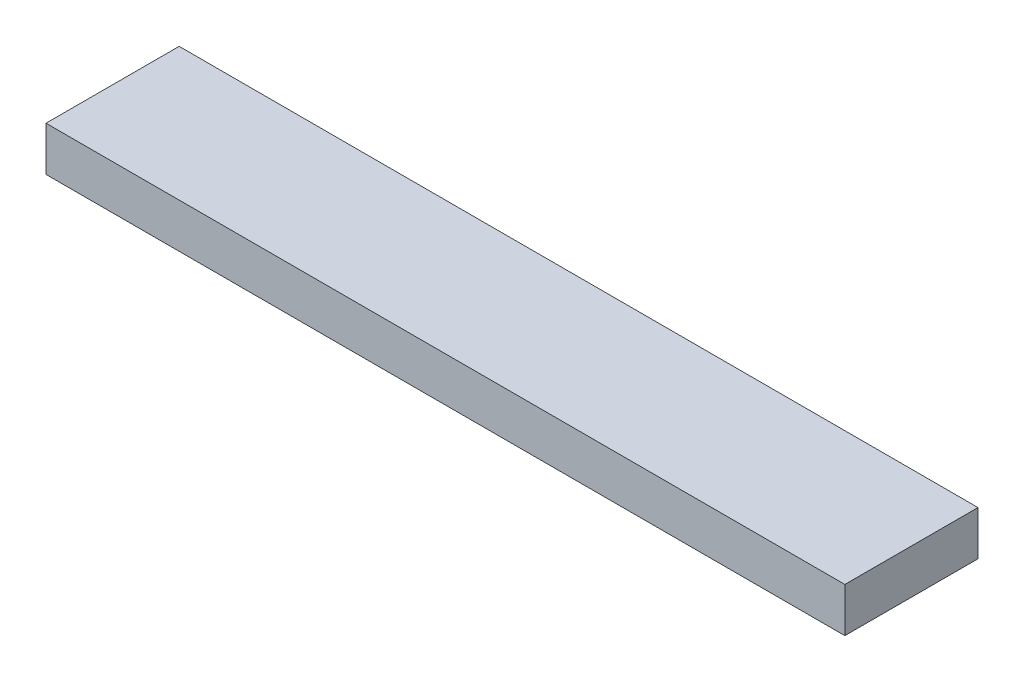
ISO-10303-21;
HEADER;
FILE_DESCRIPTION(('STEP AP214'),'2;1');
FILE_NAME('part.step','',(''),(''),'','','');
FILE_SCHEMA(('AUTOMOTIVE_DESIGN { 1 0 10303 214 1 1 1 1 }'));
ENDSEC;
DATA;
#1=APPLICATION_CONTEXT('core data for automotive mechanical design processes');
#2=APPLICATION_PROTOCOL_DEFINITION('international standard','automotive_design',2000,#1);
#3=PRODUCT_CONTEXT('',#1,'mechanical');
#4=PRODUCT('Part','Part','',(#3));
#5=PRODUCT_RELATED_PRODUCT_CATEGORY('part','',(#4));
#6=PRODUCT_DEFINITION_FORMATION('','',#4);
#7=PRODUCT_DEFINITION_CONTEXT('part definition',#1,'design');
#8=PRODUCT_DEFINITION('design','',#6,#7);
#9=PRODUCT_DEFINITION_SHAPE('','',#8);
#10=(LENGTH_UNIT() NAMED_UNIT(*) SI_UNIT(.MILLI.,.METRE.));
#11=(NAMED_UNIT(*) PLANE_ANGLE_UNIT() SI_UNIT($,.RADIAN.));
#12=(NAMED_UNIT(*) SI_UNIT($,.STERADIAN.) SOLID_ANGLE_UNIT());
#13=UNCERTAINTY_MEASURE_WITH_UNIT(LENGTH_MEASURE(1.E-05),#10,'distance_accuracy_value','');
#14=(GEOMETRIC_REPRESENTATION_CONTEXT(3) GLOBAL_UNCERTAINTY_ASSIGNED_CONTEXT((#13)) GLOBAL_UNIT_ASSIGNED_CONTEXT((#10,
#11,#12)) REPRESENTATION_CONTEXT('',''));
#15=CARTESIAN_POINT('',(0.,0.,0.));
#16=DIRECTION('',(0.,0.,1.));
#17=DIRECTION('',(1.,0.,0.));
#18=AXIS2_PLACEMENT_3D('',#15,#16,#17);
#19=CARTESIAN_POINT('',(90.,10.,15.));
#20=DIRECTION('',(-1.,0.,0.));
#21=DIRECTION('',(0.,0.,1.));
#22=AXIS2_PLACEMENT_3D('',#19,#20,#21);
#23=PLANE('',#22);
#24=DIRECTION('',(0.,0.,-1.));
#25=VECTOR('',#24,1.);
#26=CARTESIAN_POINT('',(90.,0.,15.));
#27=LINE('',#26,#25);
#28=CARTESIAN_POINT('',(90.,0.,15.));
#29=VERTEX_POINT('',#28);
#30=CARTESIAN_POINT('',(90.,0.,-15.));
#31=VERTEX_POINT('',#30);
#32=EDGE_CURVE('E111',#29,#31,#27,.T.);
#33=ORIENTED_EDGE('',*,*,#32,.T.);
#34=DIRECTION('',(0.,-1.,0.));
#35=VECTOR('',#34,1.);
#36=CARTESIAN_POINT('',(90.,10.,-15.));
#37=LINE('',#36,#35);
#38=CARTESIAN_POINT('',(90.,10.,-15.));
#39=VERTEX_POINT('',#38);
#40=EDGE_CURVE('E11',#39,#31,#37,.T.);
#41=ORIENTED_EDGE('',*,*,#40,.F.);
#42=DIRECTION('',(0.,0.,-1.));
#43=VECTOR('',#42,1.);
#44=CARTESIAN_POINT('',(90.,10.,15.));
#45=LINE('',#44,#43);
#46=CARTESIAN_POINT('',(90.,10.,15.));
#47=VERTEX_POINT('',#46);
#48=EDGE_CURVE('E95',#47,#39,#45,.T.);
#49=ORIENTED_EDGE('',*,*,#48,.F.);
#50=DIRECTION('',(0.,-1.,0.));
#51=VECTOR('',#50,1.);
#52=CARTESIAN_POINT('',(90.,10.,15.));
#53=LINE('',#52,#51);
#54=EDGE_CURVE('E107',#47,#29,#53,.T.);
#55=ORIENTED_EDGE('',*,*,#54,.T.);
#56=EDGE_LOOP('',(#33,#41,#49,#55));
#57=FACE_BOUND('',#56,.T.);
#58=ADVANCED_FACE('F43',(#57),#23,.F.);
#59=CARTESIAN_POINT('',(-90.,10.,-15.));
#60=DIRECTION('',(0.,0.,1.));
#61=DIRECTION('',(1.,0.,0.));
#62=AXIS2_PLACEMENT_3D('',#59,#60,#61);
#63=PLANE('',#62);
#64=DIRECTION('',(-1.,0.,0.));
#65=VECTOR('',#64,1.);
#66=CARTESIAN_POINT('',(-90.,0.,-15.));
#67=LINE('',#66,#65);
#68=CARTESIAN_POINT('',(-90.,0.,-15.));
#69=VERTEX_POINT('',#68);
#70=EDGE_CURVE('E100',#31,#69,#67,.T.);
#71=ORIENTED_EDGE('',*,*,#70,.T.);
#72=DIRECTION('',(0.,-1.,0.));
#73=VECTOR('',#72,1.);
#74=CARTESIAN_POINT('',(-90.,10.,-15.));
#75=LINE('',#74,#73);
#76=CARTESIAN_POINT('',(-90.,10.,-15.));
#77=VERTEX_POINT('',#76);
#78=EDGE_CURVE('E52',#77,#69,#75,.T.);
#79=ORIENTED_EDGE('',*,*,#78,.F.);
#80=DIRECTION('',(-1.,0.,0.));
#81=VECTOR('',#80,1.);
#82=CARTESIAN_POINT('',(-90.,10.,-15.));
#83=LINE('',#82,#81);
#84=EDGE_CURVE('E90',#39,#77,#83,.T.);
#85=ORIENTED_EDGE('',*,*,#84,.F.);
#86=ORIENTED_EDGE('',*,*,#40,.T.);
#87=EDGE_LOOP('',(#71,#79,#85,#86));
#88=FACE_BOUND('',#87,.T.);
#89=ADVANCED_FACE('F99',(#88),#63,.F.);
#90=CARTESIAN_POINT('',(-90.,10.,15.));
#91=DIRECTION('',(1.,0.,0.));
#92=DIRECTION('',(0.,0.,-1.));
#93=AXIS2_PLACEMENT_3D('',#90,#91,#92);
#94=PLANE('',#93);
#95=DIRECTION('',(0.,0.,1.));
#96=VECTOR('',#95,1.);
#97=CARTESIAN_POINT('',(-90.,0.,15.));
#98=LINE('',#97,#96);
#99=CARTESIAN_POINT('',(-90.,0.,15.));
#100=VERTEX_POINT('',#99);
#101=EDGE_CURVE('E77',#69,#100,#98,.T.);
#102=ORIENTED_EDGE('',*,*,#101,.T.);
#103=DIRECTION('',(0.,-1.,0.));
#104=VECTOR('',#103,1.);
#105=CARTESIAN_POINT('',(-90.,10.,15.));
#106=LINE('',#105,#104);
#107=CARTESIAN_POINT('',(-90.,10.,15.));
#108=VERTEX_POINT('',#107);
#109=EDGE_CURVE('E102',#108,#100,#106,.T.);
#110=ORIENTED_EDGE('',*,*,#109,.F.);
#111=DIRECTION('',(0.,0.,1.));
#112=VECTOR('',#111,1.);
#113=CARTESIAN_POINT('',(-90.,10.,15.));
#114=LINE('',#113,#112);
#115=EDGE_CURVE('E93',#77,#108,#114,.T.);
#116=ORIENTED_EDGE('',*,*,#115,.F.);
#117=ORIENTED_EDGE('',*,*,#78,.T.);
#118=EDGE_LOOP('',(#102,#110,#116,#117));
#119=FACE_BOUND('',#118,.T.);
#120=ADVANCED_FACE('F103',(#119),#94,.F.);
#121=CARTESIAN_POINT('',(-90.,10.,15.));
#122=DIRECTION('',(0.,0.,-1.));
#123=DIRECTION('',(-1.,0.,0.));
#124=AXIS2_PLACEMENT_3D('',#121,#122,#123);
#125=PLANE('',#124);
#126=DIRECTION('',(1.,0.,0.));
#127=VECTOR('',#126,1.);
#128=CARTESIAN_POINT('',(-90.,0.,15.));
#129=LINE('',#128,#127);
#130=EDGE_CURVE('E83',#100,#29,#129,.T.);
#131=ORIENTED_EDGE('',*,*,#130,.T.);
#132=ORIENTED_EDGE('',*,*,#54,.F.);
#133=DIRECTION('',(1.,0.,0.));
#134=VECTOR('',#133,1.);
#135=CARTESIAN_POINT('',(-90.,10.,15.));
#136=LINE('',#135,#134);
#137=EDGE_CURVE('E60',#108,#47,#136,.T.);
#138=ORIENTED_EDGE('',*,*,#137,.F.);
#139=ORIENTED_EDGE('',*,*,#109,.T.);
#140=EDGE_LOOP('',(#131,#132,#138,#139));
#141=FACE_BOUND('',#140,.T.);
#142=ADVANCED_FACE('F124',(#141),#125,.F.);
#143=CARTESIAN_POINT('',(0.,10.,0.));
#144=DIRECTION('',(0.,-1.,0.));
#145=DIRECTION('',(0.,0.,-1.));
#146=AXIS2_PLACEMENT_3D('',#143,#144,#145);
#147=PLANE('',#146);
#148=ORIENTED_EDGE('',*,*,#48,.T.);
#149=ORIENTED_EDGE('',*,*,#84,.T.);
#150=ORIENTED_EDGE('',*,*,#115,.T.);
#151=ORIENTED_EDGE('',*,*,#137,.T.);
#152=EDGE_LOOP('',(#148,#149,#150,#151));
#153=FACE_BOUND('',#152,.T.);
#154=ADVANCED_FACE('F91',(#153),#147,.F.);
#155=CARTESIAN_POINT('',(0.,0.,0.));
#156=DIRECTION('',(0.,-1.,0.));
#157=DIRECTION('',(0.,0.,-1.));
#158=AXIS2_PLACEMENT_3D('',#155,#156,#157);
#159=PLANE('',#158);
#160=ORIENTED_EDGE('',*,*,#32,.F.);
#161=ORIENTED_EDGE('',*,*,#130,.F.);
#162=ORIENTED_EDGE('',*,*,#101,.F.);
#163=ORIENTED_EDGE('',*,*,#70,.F.);
#164=EDGE_LOOP('',(#160,#161,#162,#163));
#165=FACE_BOUND('',#164,.T.);
#166=ADVANCED_FACE('F127',(#165),#159,.T.);
#167=CLOSED_SHELL('',(#58,#89,#120,#142,#154,#166));
#168=MANIFOLD_SOLID_BREP('B2',#167);
#169=ADVANCED_BREP_SHAPE_REPRESENTATION('',(#18,#168),#14);
#170=SHAPE_DEFINITION_REPRESENTATION(#9,#169);
ENDSEC;
END-ISO-10303-21;
